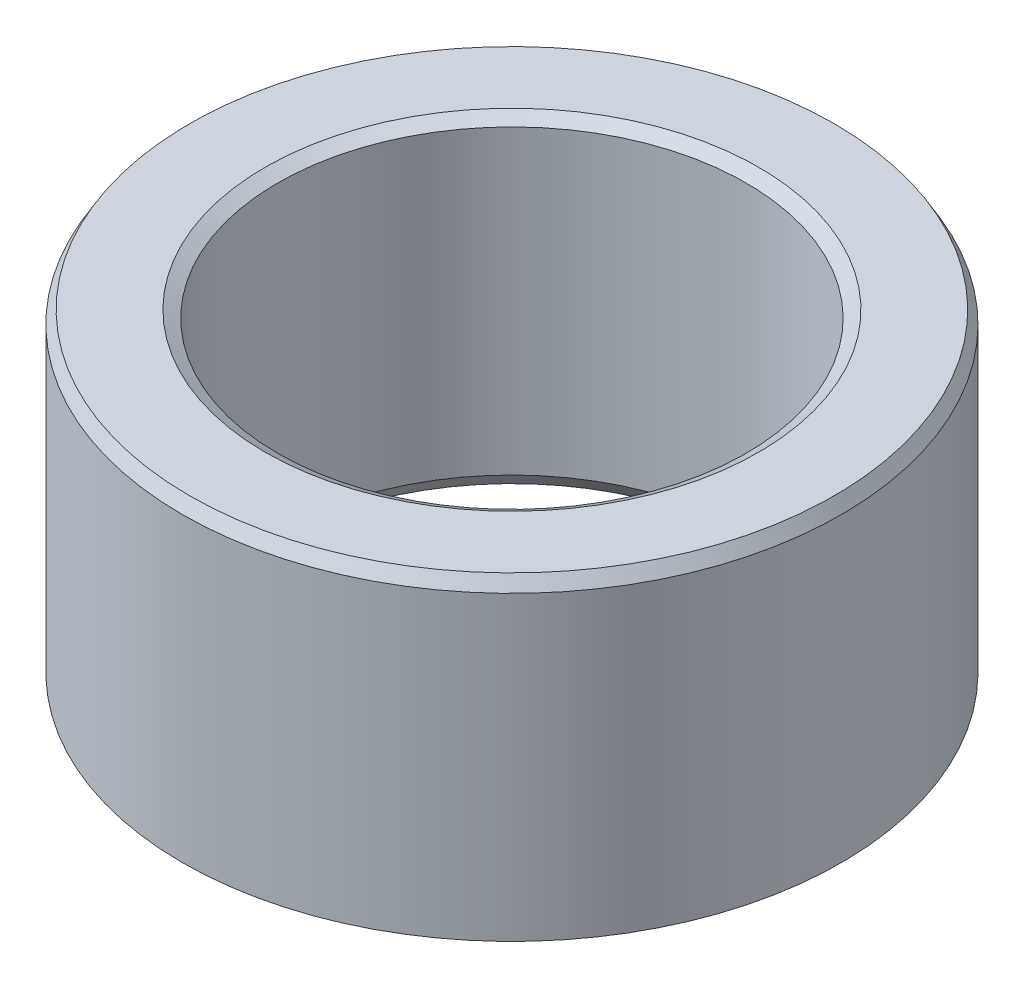
ISO-10303-21;
HEADER;
FILE_DESCRIPTION(('STEP AP214'),'2;1');
FILE_NAME('part.step','',(''),(''),'','','');
FILE_SCHEMA(('AUTOMOTIVE_DESIGN { 1 0 10303 214 1 1 1 1 }'));
ENDSEC;
DATA;
#1=APPLICATION_CONTEXT('core data for automotive mechanical design processes');
#2=APPLICATION_PROTOCOL_DEFINITION('international standard','automotive_design',2000,#1);
#3=PRODUCT_CONTEXT('',#1,'mechanical');
#4=PRODUCT('Part','Part','',(#3));
#5=PRODUCT_RELATED_PRODUCT_CATEGORY('part','',(#4));
#6=PRODUCT_DEFINITION_FORMATION('','',#4);
#7=PRODUCT_DEFINITION_CONTEXT('part definition',#1,'design');
#8=PRODUCT_DEFINITION('design','',#6,#7);
#9=PRODUCT_DEFINITION_SHAPE('','',#8);
#10=(LENGTH_UNIT() NAMED_UNIT(*) SI_UNIT(.MILLI.,.METRE.));
#11=(NAMED_UNIT(*) PLANE_ANGLE_UNIT() SI_UNIT($,.RADIAN.));
#12=(NAMED_UNIT(*) SI_UNIT($,.STERADIAN.) SOLID_ANGLE_UNIT());
#13=UNCERTAINTY_MEASURE_WITH_UNIT(LENGTH_MEASURE(1.E-05),#10,'distance_accuracy_value','');
#14=(GEOMETRIC_REPRESENTATION_CONTEXT(3) GLOBAL_UNCERTAINTY_ASSIGNED_CONTEXT((#13)) GLOBAL_UNIT_ASSIGNED_CONTEXT((#10,
#11,#12)) REPRESENTATION_CONTEXT('',''));
#15=CARTESIAN_POINT('',(0.,0.,0.));
#16=DIRECTION('',(0.,0.,1.));
#17=DIRECTION('',(1.,0.,0.));
#18=AXIS2_PLACEMENT_3D('',#15,#16,#17);
#19=CARTESIAN_POINT('',(0.,58.4985748929054,0.));
#20=DIRECTION('',(0.,-1.,0.));
#21=DIRECTION('',(0.,0.,-1.));
#22=AXIS2_PLACEMENT_3D('',#19,#20,#21);
#23=CYLINDRICAL_SURFACE('',#22,60.);
#24=CARTESIAN_POINT('',(0.,1.32457645000295,0.));
#25=DIRECTION('',(0.,1.,0.));
#26=DIRECTION('',(0.,0.,1.));
#27=AXIS2_PLACEMENT_3D('',#24,#25,#26);
#28=CIRCLE('',#27,60.);
#29=CARTESIAN_POINT('',(0.,1.32457645000295,60.));
#30=VERTEX_POINT('',#29);
#31=EDGE_CURVE('E10',#30,#30,#28,.T.);
#32=ORIENTED_EDGE('',*,*,#31,.T.);
#33=EDGE_LOOP('',(#32));
#34=FACE_BOUND('',#33,.T.);
#35=CARTESIAN_POINT('',(0.,56.204341182991,0.));
#36=DIRECTION('',(0.,1.,0.));
#37=DIRECTION('',(0.,0.,1.));
#38=AXIS2_PLACEMENT_3D('',#35,#36,#37);
#39=CIRCLE('',#38,60.);
#40=CARTESIAN_POINT('',(0.,56.204341182991,60.));
#41=VERTEX_POINT('',#40);
#42=EDGE_CURVE('E50',#41,#41,#39,.F.);
#43=ORIENTED_EDGE('',*,*,#42,.T.);
#44=EDGE_LOOP('',(#43));
#45=FACE_BOUND('',#44,.T.);
#46=ADVANCED_FACE('F39',(#34,#45),#23,.T.);
#47=CARTESIAN_POINT('',(0.,58.4985748929054,0.));
#48=DIRECTION('',(0.,1.,0.));
#49=DIRECTION('',(0.,0.,1.));
#50=AXIS2_PLACEMENT_3D('',#47,#48,#49);
#51=PLANE('',#50);
#52=CARTESIAN_POINT('',(0.,58.4985748929054,0.));
#53=DIRECTION('',(0.,1.,0.));
#54=DIRECTION('',(0.,0.,1.));
#55=AXIS2_PLACEMENT_3D('',#52,#53,#54);
#56=CIRCLE('',#55,44.9325567178296);
#57=CARTESIAN_POINT('',(0.,58.4985748929054,44.9325567178296));
#58=VERTEX_POINT('',#57);
#59=EDGE_CURVE('E58',#58,#58,#56,.F.);
#60=ORIENTED_EDGE('',*,*,#59,.T.);
#61=EDGE_LOOP('',(#60));
#62=FACE_BOUND('',#61,.T.);
#63=CARTESIAN_POINT('',(0.,58.4985748929054,0.));
#64=DIRECTION('',(0.,1.,0.));
#65=DIRECTION('',(0.,0.,1.));
#66=AXIS2_PLACEMENT_3D('',#63,#64,#65);
#67=CIRCLE('',#66,58.675423549997);
#68=CARTESIAN_POINT('',(0.,58.4985748929054,58.675423549997));
#69=VERTEX_POINT('',#68);
#70=EDGE_CURVE('E61',#69,#69,#67,.T.);
#71=ORIENTED_EDGE('',*,*,#70,.T.);
#72=EDGE_LOOP('',(#71));
#73=FACE_BOUND('',#72,.T.);
#74=ADVANCED_FACE('F88',(#62,#73),#51,.T.);
#75=CARTESIAN_POINT('',(0.,0.,0.));
#76=DIRECTION('',(0.,1.,0.));
#77=DIRECTION('',(0.,0.,1.));
#78=AXIS2_PLACEMENT_3D('',#75,#76,#77);
#79=PLANE('',#78);
#80=CARTESIAN_POINT('',(0.,0.,0.));
#81=DIRECTION('',(0.,1.,0.));
#82=DIRECTION('',(0.,0.,1.));
#83=AXIS2_PLACEMENT_3D('',#80,#81,#82);
#84=CIRCLE('',#83,43.9628994579182);
#85=CARTESIAN_POINT('',(0.,0.,43.9628994579182));
#86=VERTEX_POINT('',#85);
#87=EDGE_CURVE('E51',#86,#86,#84,.T.);
#88=ORIENTED_EDGE('',*,*,#87,.T.);
#89=EDGE_LOOP('',(#88));
#90=FACE_BOUND('',#89,.T.);
#91=CARTESIAN_POINT('',(0.,0.,0.));
#92=DIRECTION('',(0.,1.,0.));
#93=DIRECTION('',(0.,0.,1.));
#94=AXIS2_PLACEMENT_3D('',#91,#92,#93);
#95=CIRCLE('',#94,57.7057662900856);
#96=CARTESIAN_POINT('',(0.,0.,57.7057662900856));
#97=VERTEX_POINT('',#96);
#98=EDGE_CURVE('E54',#97,#97,#95,.F.);
#99=ORIENTED_EDGE('',*,*,#98,.T.);
#100=EDGE_LOOP('',(#99));
#101=FACE_BOUND('',#100,.T.);
#102=ADVANCED_FACE('F83',(#90,#101),#79,.F.);
#103=CARTESIAN_POINT('',(0.,58.4985748929054,0.));
#104=DIRECTION('',(0.,-1.,0.));
#105=DIRECTION('',(0.,0.,-1.));
#106=AXIS2_PLACEMENT_3D('',#103,#104,#105);
#107=CYLINDRICAL_SURFACE('',#106,42.6383230079152);
#108=CARTESIAN_POINT('',(0.,57.1739984429024,0.));
#109=DIRECTION('',(0.,1.,0.));
#110=DIRECTION('',(0.,0.,1.));
#111=AXIS2_PLACEMENT_3D('',#108,#109,#110);
#112=CIRCLE('',#111,42.6383230079152);
#113=CARTESIAN_POINT('',(0.,57.1739984429024,42.6383230079152));
#114=VERTEX_POINT('',#113);
#115=EDGE_CURVE('E67',#114,#114,#112,.T.);
#116=ORIENTED_EDGE('',*,*,#115,.T.);
#117=EDGE_LOOP('',(#116));
#118=FACE_BOUND('',#117,.T.);
#119=CARTESIAN_POINT('',(0.,2.29423370991433,0.));
#120=DIRECTION('',(0.,1.,0.));
#121=DIRECTION('',(0.,0.,1.));
#122=AXIS2_PLACEMENT_3D('',#119,#120,#121);
#123=CIRCLE('',#122,42.6383230079152);
#124=CARTESIAN_POINT('',(0.,2.29423370991433,42.6383230079152));
#125=VERTEX_POINT('',#124);
#126=EDGE_CURVE('E69',#125,#125,#123,.F.);
#127=ORIENTED_EDGE('',*,*,#126,.T.);
#128=EDGE_LOOP('',(#127));
#129=FACE_BOUND('',#128,.T.);
#130=ADVANCED_FACE('F71',(#118,#129),#107,.F.);
#131=CARTESIAN_POINT('',(0.,57.1739984429024,0.));
#132=DIRECTION('',(0.,1.,0.));
#133=DIRECTION('',(0.,0.,1.));
#134=AXIS2_PLACEMENT_3D('',#131,#132,#133);
#135=CONICAL_SURFACE('',#134,42.6383230079152,1.0471975511966);
#136=ORIENTED_EDGE('',*,*,#59,.F.);
#137=EDGE_LOOP('',(#136));
#138=FACE_BOUND('',#137,.T.);
#139=ORIENTED_EDGE('',*,*,#115,.F.);
#140=EDGE_LOOP('',(#139));
#141=FACE_BOUND('',#140,.T.);
#142=ADVANCED_FACE('F77',(#138,#141),#135,.F.);
#143=CARTESIAN_POINT('',(0.,0.,0.));
#144=DIRECTION('',(0.,-1.,0.));
#145=DIRECTION('',(0.,0.,-1.));
#146=AXIS2_PLACEMENT_3D('',#143,#144,#145);
#147=CONICAL_SURFACE('',#146,43.9628994579182,0.523598775598299);
#148=ORIENTED_EDGE('',*,*,#126,.F.);
#149=EDGE_LOOP('',(#148));
#150=FACE_BOUND('',#149,.T.);
#151=ORIENTED_EDGE('',*,*,#87,.F.);
#152=EDGE_LOOP('',(#151));
#153=FACE_BOUND('',#152,.T.);
#154=ADVANCED_FACE('F73',(#150,#153),#147,.F.);
#155=CARTESIAN_POINT('',(0.,1.32457645000295,0.));
#156=DIRECTION('',(0.,1.,0.));
#157=DIRECTION('',(0.,0.,1.));
#158=AXIS2_PLACEMENT_3D('',#155,#156,#157);
#159=CONICAL_SURFACE('',#158,60.,1.0471975511966);
#160=ORIENTED_EDGE('',*,*,#98,.F.);
#161=EDGE_LOOP('',(#160));
#162=FACE_BOUND('',#161,.T.);
#163=ORIENTED_EDGE('',*,*,#31,.F.);
#164=EDGE_LOOP('',(#163));
#165=FACE_BOUND('',#164,.T.);
#166=ADVANCED_FACE('F76',(#162,#165),#159,.T.);
#167=CARTESIAN_POINT('',(0.,58.4985748929054,0.));
#168=DIRECTION('',(0.,-1.,0.));
#169=DIRECTION('',(0.,0.,-1.));
#170=AXIS2_PLACEMENT_3D('',#167,#168,#169);
#171=CONICAL_SURFACE('',#170,58.675423549997,0.523598775598296);
#172=ORIENTED_EDGE('',*,*,#42,.F.);
#173=EDGE_LOOP('',(#172));
#174=FACE_BOUND('',#173,.T.);
#175=ORIENTED_EDGE('',*,*,#70,.F.);
#176=EDGE_LOOP('',(#175));
#177=FACE_BOUND('',#176,.T.);
#178=ADVANCED_FACE('F45',(#174,#177),#171,.T.);
#179=CLOSED_SHELL('',(#46,#74,#102,#130,#142,#154,#166,#178));
#180=MANIFOLD_SOLID_BREP('B2',#179);
#181=ADVANCED_BREP_SHAPE_REPRESENTATION('',(#18,#180),#14);
#182=SHAPE_DEFINITION_REPRESENTATION(#9,#181);
ENDSEC;
END-ISO-10303-21;
